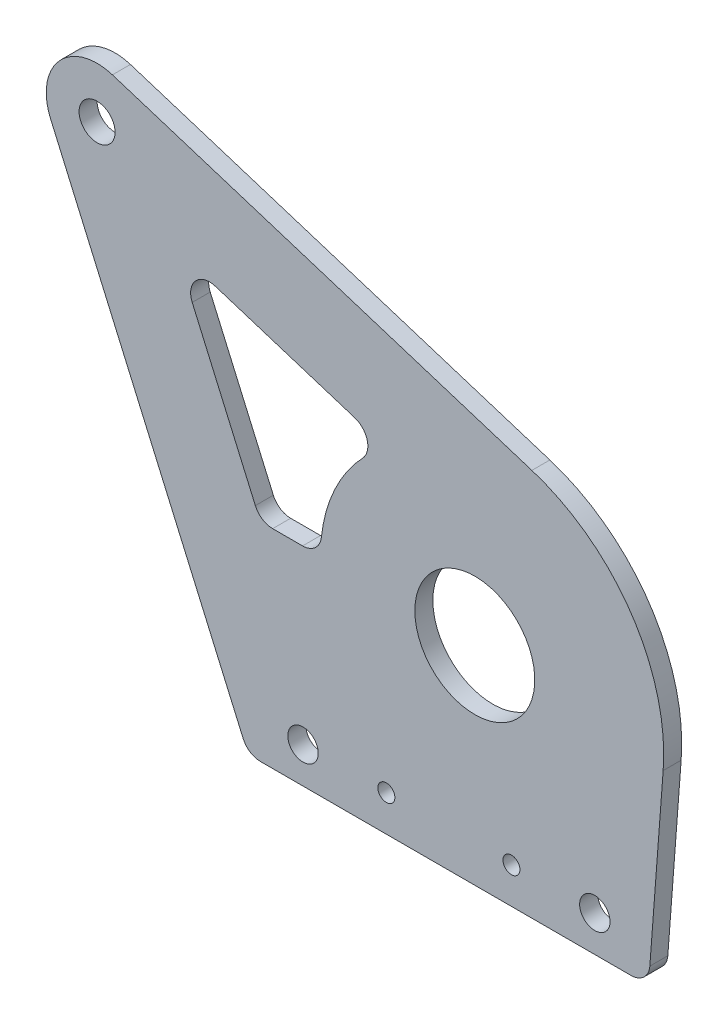
ISO-10303-21;
HEADER;
FILE_DESCRIPTION(('STEP AP214'),'2;1');
FILE_NAME('part.step','',(''),(''),'','','');
FILE_SCHEMA(('AUTOMOTIVE_DESIGN { 1 0 10303 214 1 1 1 1 }'));
ENDSEC;
DATA;
#1=APPLICATION_CONTEXT('core data for automotive mechanical design processes');
#2=APPLICATION_PROTOCOL_DEFINITION('international standard','automotive_design',2000,#1);
#3=PRODUCT_CONTEXT('',#1,'mechanical');
#4=PRODUCT('Part','Part','',(#3));
#5=PRODUCT_RELATED_PRODUCT_CATEGORY('part','',(#4));
#6=PRODUCT_DEFINITION_FORMATION('','',#4);
#7=PRODUCT_DEFINITION_CONTEXT('part definition',#1,'design');
#8=PRODUCT_DEFINITION('design','',#6,#7);
#9=PRODUCT_DEFINITION_SHAPE('','',#8);
#10=(LENGTH_UNIT() NAMED_UNIT(*) SI_UNIT(.MILLI.,.METRE.));
#11=(NAMED_UNIT(*) PLANE_ANGLE_UNIT() SI_UNIT($,.RADIAN.));
#12=(NAMED_UNIT(*) SI_UNIT($,.STERADIAN.) SOLID_ANGLE_UNIT());
#13=UNCERTAINTY_MEASURE_WITH_UNIT(LENGTH_MEASURE(1.E-05),#10,'distance_accuracy_value','');
#14=(GEOMETRIC_REPRESENTATION_CONTEXT(3) GLOBAL_UNCERTAINTY_ASSIGNED_CONTEXT((#13)) GLOBAL_UNIT_ASSIGNED_CONTEXT((#10,
#11,#12)) REPRESENTATION_CONTEXT('',''));
#15=CARTESIAN_POINT('',(0.,0.,0.));
#16=DIRECTION('',(0.,0.,1.));
#17=DIRECTION('',(1.,0.,0.));
#18=AXIS2_PLACEMENT_3D('',#15,#16,#17);
#19=CARTESIAN_POINT('',(-45.9765237436757,55.,34.7625));
#20=DIRECTION('',(0.,0.,-1.));
#21=DIRECTION('',(-1.,0.,0.));
#22=AXIS2_PLACEMENT_3D('',#19,#20,#21);
#23=CYLINDRICAL_SURFACE('',#22,50.);
#24=CARTESIAN_POINT('',(-45.9765237436757,55.,30.));
#25=DIRECTION('',(0.,0.,1.));
#26=DIRECTION('',(-1.,0.,0.));
#27=AXIS2_PLACEMENT_3D('',#24,#25,#26);
#28=CIRCLE('',#27,50.);
#29=CARTESIAN_POINT('',(3.88060445728038,51.2228625185952,30.));
#30=VERTEX_POINT('',#29);
#31=CARTESIAN_POINT('',(-30.8816537026386,102.667021077934,30.));
#32=VERTEX_POINT('',#31);
#33=EDGE_CURVE('E184',#30,#32,#28,.T.);
#34=ORIENTED_EDGE('',*,*,#33,.T.);
#35=DIRECTION('',(0.,0.,-1.));
#36=VECTOR('',#35,1.);
#37=CARTESIAN_POINT('',(-30.8816537026386,102.667021077934,34.7625));
#38=LINE('',#37,#36);
#39=CARTESIAN_POINT('',(-30.8816537026386,102.667021077934,34.7625));
#40=VERTEX_POINT('',#39);
#41=EDGE_CURVE('E162',#40,#32,#38,.T.);
#42=ORIENTED_EDGE('',*,*,#41,.F.);
#43=CARTESIAN_POINT('',(-45.9765237436757,55.,34.7625));
#44=DIRECTION('',(0.,0.,1.));
#45=DIRECTION('',(-1.,0.,0.));
#46=AXIS2_PLACEMENT_3D('',#43,#44,#45);
#47=CIRCLE('',#46,50.);
#48=CARTESIAN_POINT('',(3.88060445728038,51.2228625185952,34.7625));
#49=VERTEX_POINT('',#48);
#50=EDGE_CURVE('E170',#49,#40,#47,.T.);
#51=ORIENTED_EDGE('',*,*,#50,.F.);
#52=DIRECTION('',(0.,0.,-1.));
#53=VECTOR('',#52,1.);
#54=CARTESIAN_POINT('',(3.88060445728038,51.2228625185952,34.7625));
#55=LINE('',#54,#53);
#56=EDGE_CURVE('E367',#49,#30,#55,.T.);
#57=ORIENTED_EDGE('',*,*,#56,.T.);
#58=EDGE_LOOP('',(#34,#42,#51,#57));
#59=FACE_BOUND('',#58,.T.);
#60=ADVANCED_FACE('F44',(#59),#23,.T.);
#61=CARTESIAN_POINT('',(-141.914219316021,137.828063458088,34.7625));
#62=DIRECTION('',(-0.301897400820741,-0.95334042155868,0.));
#63=DIRECTION('',(0.95334042155868,-0.301897400820741,0.));
#64=AXIS2_PLACEMENT_3D('',#61,#62,#63);
#65=PLANE('',#64);
#66=DIRECTION('',(-0.95334042155868,0.301897400820741,0.));
#67=VECTOR('',#66,1.);
#68=CARTESIAN_POINT('',(-141.914219316021,137.828063458088,30.));
#69=LINE('',#68,#67);
#70=CARTESIAN_POINT('',(-141.914219316021,137.828063458088,30.));
#71=VERTEX_POINT('',#70);
#72=EDGE_CURVE('E369',#32,#71,#69,.T.);
#73=ORIENTED_EDGE('',*,*,#72,.T.);
#74=DIRECTION('',(0.,0.,-1.));
#75=VECTOR('',#74,1.);
#76=CARTESIAN_POINT('',(-141.914219316021,137.828063458088,34.7625));
#77=LINE('',#76,#75);
#78=CARTESIAN_POINT('',(-141.914219316021,137.828063458088,34.7625));
#79=VERTEX_POINT('',#78);
#80=EDGE_CURVE('E165',#79,#71,#77,.T.);
#81=ORIENTED_EDGE('',*,*,#80,.F.);
#82=DIRECTION('',(-0.95334042155868,0.301897400820741,0.));
#83=VECTOR('',#82,1.);
#84=CARTESIAN_POINT('',(-141.914219316021,137.828063458088,34.7625));
#85=LINE('',#84,#83);
#86=EDGE_CURVE('E158',#40,#79,#85,.T.);
#87=ORIENTED_EDGE('',*,*,#86,.F.);
#88=ORIENTED_EDGE('',*,*,#41,.T.);
#89=EDGE_LOOP('',(#73,#81,#87,#88));
#90=FACE_BOUND('',#89,.T.);
#91=ADVANCED_FACE('F160',(#90),#65,.F.);
#92=CARTESIAN_POINT('',(-145.976523743676,125.,34.7625));
#93=DIRECTION('',(0.,0.,-1.));
#94=DIRECTION('',(-1.,0.,0.));
#95=AXIS2_PLACEMENT_3D('',#92,#93,#94);
#96=CYLINDRICAL_SURFACE('',#95,13.4559105729665);
#97=CARTESIAN_POINT('',(-145.976523743676,125.,30.));
#98=DIRECTION('',(0.,0.,1.));
#99=DIRECTION('',(1.,0.,0.));
#100=AXIS2_PLACEMENT_3D('',#97,#98,#99);
#101=CIRCLE('',#100,13.4559105729665);
#102=CARTESIAN_POINT('',(-158.305149544898,119.608662948663,30.));
#103=VERTEX_POINT('',#102);
#104=EDGE_CURVE('E372',#71,#103,#101,.T.);
#105=ORIENTED_EDGE('',*,*,#104,.T.);
#106=DIRECTION('',(0.,0.,-1.));
#107=VECTOR('',#106,1.);
#108=CARTESIAN_POINT('',(-158.305149544898,119.608662948663,34.7625));
#109=LINE('',#108,#107);
#110=CARTESIAN_POINT('',(-158.305149544898,119.608662948663,34.7625));
#111=VERTEX_POINT('',#110);
#112=EDGE_CURVE('E195',#111,#103,#109,.T.);
#113=ORIENTED_EDGE('',*,*,#112,.F.);
#114=CARTESIAN_POINT('',(-145.976523743676,125.,34.7625));
#115=DIRECTION('',(0.,0.,1.));
#116=DIRECTION('',(1.,0.,0.));
#117=AXIS2_PLACEMENT_3D('',#114,#115,#116);
#118=CIRCLE('',#117,13.4559105729665);
#119=EDGE_CURVE('E169',#79,#111,#118,.T.);
#120=ORIENTED_EDGE('',*,*,#119,.F.);
#121=ORIENTED_EDGE('',*,*,#80,.T.);
#122=EDGE_LOOP('',(#105,#113,#120,#121));
#123=FACE_BOUND('',#122,.T.);
#124=ADVANCED_FACE('F414',(#123),#96,.T.);
#125=CARTESIAN_POINT('',(-106.,0.,34.7625));
#126=DIRECTION('',(0.916223821076116,0.400666831285897,0.));
#127=DIRECTION('',(-0.400666831285897,0.916223821076116,0.));
#128=AXIS2_PLACEMENT_3D('',#125,#126,#127);
#129=PLANE('',#128);
#130=DIRECTION('',(0.400666831285897,-0.916223821076116,0.));
#131=VECTOR('',#130,1.);
#132=CARTESIAN_POINT('',(-106.,0.,30.));
#133=LINE('',#132,#131);
#134=CARTESIAN_POINT('',(-107.310449019494,2.9966658435705,30.));
#135=VERTEX_POINT('',#134);
#136=EDGE_CURVE('E375',#103,#135,#133,.T.);
#137=ORIENTED_EDGE('',*,*,#136,.T.);
#138=DIRECTION('',(0.,0.,-1.));
#139=VECTOR('',#138,1.);
#140=CARTESIAN_POINT('',(-107.310449019494,2.9966658435705,34.7625));
#141=LINE('',#140,#139);
#142=CARTESIAN_POINT('',(-107.310449019494,2.9966658435705,34.7625));
#143=VERTEX_POINT('',#142);
#144=EDGE_CURVE('E227',#135,#143,#141,.F.);
#145=ORIENTED_EDGE('',*,*,#144,.T.);
#146=DIRECTION('',(0.400666831285897,-0.916223821076116,0.));
#147=VECTOR('',#146,1.);
#148=CARTESIAN_POINT('',(-106.,0.,34.7625));
#149=LINE('',#148,#147);
#150=EDGE_CURVE('E359',#111,#143,#149,.T.);
#151=ORIENTED_EDGE('',*,*,#150,.F.);
#152=ORIENTED_EDGE('',*,*,#112,.T.);
#153=EDGE_LOOP('',(#137,#145,#151,#152));
#154=FACE_BOUND('',#153,.T.);
#155=ADVANCED_FACE('F392',(#154),#129,.F.);
#156=CARTESIAN_POINT('',(0.,0.,34.7625));
#157=DIRECTION('',(0.,1.,0.));
#158=DIRECTION('',(-1.,0.,0.));
#159=AXIS2_PLACEMENT_3D('',#156,#157,#158);
#160=PLANE('',#159);
#161=DIRECTION('',(1.,0.,0.));
#162=VECTOR('',#161,1.);
#163=CARTESIAN_POINT('',(0.,0.,30.));
#164=LINE('',#163,#162);
#165=CARTESIAN_POINT('',(-102.729329914113,0.,30.));
#166=VERTEX_POINT('',#165);
#167=CARTESIAN_POINT('',(-4.63553198775184,0.,30.));
#168=VERTEX_POINT('',#167);
#169=EDGE_CURVE('E379',#166,#168,#164,.T.);
#170=ORIENTED_EDGE('',*,*,#169,.T.);
#171=DIRECTION('',(0.,0.,-1.));
#172=VECTOR('',#171,1.);
#173=CARTESIAN_POINT('',(-4.63553198775184,0.,34.7625));
#174=LINE('',#173,#172);
#175=CARTESIAN_POINT('',(-4.63553198775184,0.,34.7625));
#176=VERTEX_POINT('',#175);
#177=EDGE_CURVE('E219',#168,#176,#174,.F.);
#178=ORIENTED_EDGE('',*,*,#177,.T.);
#179=DIRECTION('',(1.,0.,0.));
#180=VECTOR('',#179,1.);
#181=CARTESIAN_POINT('',(0.,0.,34.7625));
#182=LINE('',#181,#180);
#183=CARTESIAN_POINT('',(-102.729329914113,0.,34.7625));
#184=VERTEX_POINT('',#183);
#185=EDGE_CURVE('E362',#184,#176,#182,.T.);
#186=ORIENTED_EDGE('',*,*,#185,.F.);
#187=DIRECTION('',(0.,0.,-1.));
#188=VECTOR('',#187,1.);
#189=CARTESIAN_POINT('',(-102.729329914113,0.,34.7625));
#190=LINE('',#189,#188);
#191=EDGE_CURVE('E215',#184,#166,#190,.T.);
#192=ORIENTED_EDGE('',*,*,#191,.T.);
#193=EDGE_LOOP('',(#170,#178,#186,#192));
#194=FACE_BOUND('',#193,.T.);
#195=ADVANCED_FACE('F406',(#194),#160,.F.);
#196=CARTESIAN_POINT('',(0.,0.,34.7625));
#197=DIRECTION('',(-0.997142564019121,0.0755427496280952,0.));
#198=DIRECTION('',(-0.0755427496280952,-0.997142564019121,0.));
#199=AXIS2_PLACEMENT_3D('',#196,#197,#198);
#200=PLANE('',#199);
#201=DIRECTION('',(0.0755427496280952,0.997142564019121,0.));
#202=VECTOR('',#201,1.);
#203=CARTESIAN_POINT('',(0.,0.,34.7625));
#204=LINE('',#203,#202);
#205=CARTESIAN_POINT('',(0.350180832343764,4.62228625185952,34.7625));
#206=VERTEX_POINT('',#205);
#207=EDGE_CURVE('E176',#206,#49,#204,.T.);
#208=ORIENTED_EDGE('',*,*,#207,.F.);
#209=DIRECTION('',(0.,0.,-1.));
#210=VECTOR('',#209,1.);
#211=CARTESIAN_POINT('',(0.350180832343764,4.62228625185952,34.7625));
#212=LINE('',#211,#210);
#213=CARTESIAN_POINT('',(0.350180832343764,4.62228625185952,30.));
#214=VERTEX_POINT('',#213);
#215=EDGE_CURVE('E186',#206,#214,#212,.T.);
#216=ORIENTED_EDGE('',*,*,#215,.T.);
#217=DIRECTION('',(0.0755427496280952,0.997142564019121,0.));
#218=VECTOR('',#217,1.);
#219=CARTESIAN_POINT('',(0.,0.,30.));
#220=LINE('',#219,#218);
#221=EDGE_CURVE('E181',#214,#30,#220,.T.);
#222=ORIENTED_EDGE('',*,*,#221,.T.);
#223=ORIENTED_EDGE('',*,*,#56,.F.);
#224=EDGE_LOOP('',(#208,#216,#222,#223));
#225=FACE_BOUND('',#224,.T.);
#226=ADVANCED_FACE('F413',(#225),#200,.F.);
#227=CARTESIAN_POINT('',(-45.9765237436757,55.,34.7625));
#228=DIRECTION('',(0.,0.,-1.));
#229=DIRECTION('',(-1.,0.,0.));
#230=AXIS2_PLACEMENT_3D('',#227,#228,#229);
#231=PLANE('',#230);
#232=DIRECTION('',(1.,0.,0.));
#233=VECTOR('',#232,1.);
#234=CARTESIAN_POINT('',(-102.765720109967,55.,34.7625));
#235=LINE('',#234,#233);
#236=CARTESIAN_POINT('',(-99.4950500240803,55.,34.7625));
#237=VERTEX_POINT('',#236);
#238=CARTESIAN_POINT('',(-91.5782301262224,55.,34.7625));
#239=VERTEX_POINT('',#238);
#240=EDGE_CURVE('E314',#237,#239,#235,.T.);
#241=ORIENTED_EDGE('',*,*,#240,.F.);
#242=CARTESIAN_POINT('',(-99.4950500240803,60.,34.7625));
#243=DIRECTION('',(0.,0.,-1.));
#244=DIRECTION('',(-1.,0.,0.));
#245=AXIS2_PLACEMENT_3D('',#242,#243,#244);
#246=CIRCLE('',#245,5.);
#247=CARTESIAN_POINT('',(-104.076169129461,57.9966658435705,34.7625));
#248=VERTEX_POINT('',#247);
#249=EDGE_CURVE('E269',#237,#248,#246,.T.);
#250=ORIENTED_EDGE('',*,*,#249,.T.);
#251=DIRECTION('',(0.400666831285897,-0.916223821076116,0.));
#252=VECTOR('',#251,1.);
#253=CARTESIAN_POINT('',(-125.205078879288,106.313144559887,34.7625));
#254=LINE('',#253,#252);
#255=CARTESIAN_POINT('',(-120.7896266242,96.2161207459809,34.7625));
#256=VERTEX_POINT('',#255);
#257=EDGE_CURVE('E283',#256,#248,#254,.T.);
#258=ORIENTED_EDGE('',*,*,#257,.F.);
#259=CARTESIAN_POINT('',(-116.208507518819,98.2194549024104,34.7625));
#260=DIRECTION('',(0.,0.,-1.));
#261=DIRECTION('',(-1.,0.,0.));
#262=AXIS2_PLACEMENT_3D('',#259,#260,#261);
#263=CIRCLE('',#262,5.);
#264=CARTESIAN_POINT('',(-114.699020514716,102.986157010204,34.7625));
#265=VERTEX_POINT('',#264);
#266=EDGE_CURVE('E53',#256,#265,#263,.T.);
#267=ORIENTED_EDGE('',*,*,#266,.T.);
#268=DIRECTION('',(-0.95334042155868,0.30189740082074,0.));
#269=VECTOR('',#268,1.);
#270=CARTESIAN_POINT('',(-125.205078879288,106.313144559887,34.7625));
#271=LINE('',#270,#269);
#272=CARTESIAN_POINT('',(-77.7884915726018,91.297580192781,34.7625));
#273=VERTEX_POINT('',#272);
#274=EDGE_CURVE('E282',#273,#265,#271,.T.);
#275=ORIENTED_EDGE('',*,*,#274,.F.);
#276=CARTESIAN_POINT('',(-79.2979785767055,86.5308780849876,34.7625));
#277=DIRECTION('',(0.,0.,-1.));
#278=DIRECTION('',(-1.,0.,0.));
#279=AXIS2_PLACEMENT_3D('',#276,#277,#278);
#280=CIRCLE('',#279,5.);
#281=CARTESIAN_POINT('',(-75.6662123823698,83.0942701193214,34.7625));
#282=VERTEX_POINT('',#281);
#283=EDGE_CURVE('E257',#273,#282,#280,.T.);
#284=ORIENTED_EDGE('',*,*,#283,.T.);
#285=CARTESIAN_POINT('',(-45.9765237436757,55.,34.7625));
#286=DIRECTION('',(0.,0.,-1.));
#287=DIRECTION('',(1.,0.,0.));
#288=AXIS2_PLACEMENT_3D('',#285,#286,#287);
#289=CIRCLE('',#288,40.875);
#290=CARTESIAN_POINT('',(-86.608016896517,59.4550408719346,34.7625));
#291=VERTEX_POINT('',#290);
#292=EDGE_CURVE('E293',#291,#282,#289,.T.);
#293=ORIENTED_EDGE('',*,*,#292,.F.);
#294=CARTESIAN_POINT('',(-91.5782301262224,60.,34.7625));
#295=DIRECTION('',(0.,0.,-1.));
#296=DIRECTION('',(-1.,0.,0.));
#297=AXIS2_PLACEMENT_3D('',#294,#295,#296);
#298=CIRCLE('',#297,5.);
#299=EDGE_CURVE('E263',#291,#239,#298,.T.);
#300=ORIENTED_EDGE('',*,*,#299,.T.);
#301=EDGE_LOOP('',(#241,#250,#258,#267,#275,#284,#293,#300));
#302=FACE_BOUND('',#301,.T.);
#303=CARTESIAN_POINT('',(-69.3886421718834,9.525,34.7625));
#304=DIRECTION('',(0.,0.,1.));
#305=DIRECTION('',(1.,0.,0.));
#306=AXIS2_PLACEMENT_3D('',#303,#304,#305);
#307=CIRCLE('',#306,2.24999999999999);
#308=CARTESIAN_POINT('',(-67.1386421718834,9.525,34.7625));
#309=VERTEX_POINT('',#308);
#310=EDGE_CURVE('E311',#309,#309,#307,.T.);
#311=ORIENTED_EDGE('',*,*,#310,.F.);
#312=EDGE_LOOP('',(#311));
#313=FACE_BOUND('',#312,.T.);
#314=CARTESIAN_POINT('',(-36.2818211132944,9.525,34.7625));
#315=DIRECTION('',(0.,0.,1.));
#316=DIRECTION('',(1.,0.,0.));
#317=AXIS2_PLACEMENT_3D('',#314,#315,#316);
#318=CIRCLE('',#317,2.25);
#319=CARTESIAN_POINT('',(-34.0318211132945,9.525,34.7625));
#320=VERTEX_POINT('',#319);
#321=EDGE_CURVE('E328',#320,#320,#318,.T.);
#322=ORIENTED_EDGE('',*,*,#321,.F.);
#323=EDGE_LOOP('',(#322));
#324=FACE_BOUND('',#323,.T.);
#325=CARTESIAN_POINT('',(-91.4598564098834,9.52499999999999,34.7625));
#326=DIRECTION('',(0.,0.,1.));
#327=DIRECTION('',(1.,0.,0.));
#328=AXIS2_PLACEMENT_3D('',#325,#326,#327);
#329=CIRCLE('',#328,4.025);
#330=CARTESIAN_POINT('',(-87.4348564098834,9.52499999999999,34.7625));
#331=VERTEX_POINT('',#330);
#332=EDGE_CURVE('E204',#331,#331,#329,.T.);
#333=ORIENTED_EDGE('',*,*,#332,.F.);
#334=EDGE_LOOP('',(#333));
#335=FACE_BOUND('',#334,.T.);
#336=CARTESIAN_POINT('',(-14.2106070377648,9.52500000000001,34.7625));
#337=DIRECTION('',(0.,0.,1.));
#338=DIRECTION('',(1.,0.,0.));
#339=AXIS2_PLACEMENT_3D('',#336,#337,#338);
#340=CIRCLE('',#339,4.025);
#341=CARTESIAN_POINT('',(-10.1856070377648,9.52500000000001,34.7625));
#342=VERTEX_POINT('',#341);
#343=EDGE_CURVE('E344',#342,#342,#340,.T.);
#344=ORIENTED_EDGE('',*,*,#343,.F.);
#345=EDGE_LOOP('',(#344));
#346=FACE_BOUND('',#345,.T.);
#347=CARTESIAN_POINT('',(-45.9765237436757,55.,34.7625));
#348=DIRECTION('',(0.,0.,-1.));
#349=DIRECTION('',(-1.,0.,0.));
#350=AXIS2_PLACEMENT_3D('',#347,#348,#349);
#351=CIRCLE('',#350,15.875);
#352=CARTESIAN_POINT('',(-61.8515237436757,55.,34.7625));
#353=VERTEX_POINT('',#352);
#354=EDGE_CURVE('E208',#353,#353,#351,.T.);
#355=ORIENTED_EDGE('',*,*,#354,.T.);
#356=EDGE_LOOP('',(#355));
#357=FACE_BOUND('',#356,.T.);
#358=CARTESIAN_POINT('',(-145.976523743676,125.,34.7625));
#359=DIRECTION('',(0.,0.,-1.));
#360=DIRECTION('',(-1.,0.,0.));
#361=AXIS2_PLACEMENT_3D('',#358,#359,#360);
#362=CIRCLE('',#361,4.76250000000001);
#363=CARTESIAN_POINT('',(-150.739023743676,125.,34.7625));
#364=VERTEX_POINT('',#363);
#365=EDGE_CURVE('E203',#364,#364,#362,.T.);
#366=ORIENTED_EDGE('',*,*,#365,.T.);
#367=EDGE_LOOP('',(#366));
#368=FACE_BOUND('',#367,.T.);
#369=ORIENTED_EDGE('',*,*,#185,.T.);
#370=CARTESIAN_POINT('',(-4.63553198775184,5.,34.7625));
#371=DIRECTION('',(0.,0.,-1.));
#372=DIRECTION('',(-1.,0.,0.));
#373=AXIS2_PLACEMENT_3D('',#370,#371,#372);
#374=CIRCLE('',#373,5.);
#375=EDGE_CURVE('E224',#176,#206,#374,.F.);
#376=ORIENTED_EDGE('',*,*,#375,.T.);
#377=ORIENTED_EDGE('',*,*,#207,.T.);
#378=ORIENTED_EDGE('',*,*,#50,.T.);
#379=ORIENTED_EDGE('',*,*,#86,.T.);
#380=ORIENTED_EDGE('',*,*,#119,.T.);
#381=ORIENTED_EDGE('',*,*,#150,.T.);
#382=CARTESIAN_POINT('',(-102.729329914113,4.99999999999998,34.7625));
#383=DIRECTION('',(0.,0.,-1.));
#384=DIRECTION('',(-1.,0.,0.));
#385=AXIS2_PLACEMENT_3D('',#382,#383,#384);
#386=CIRCLE('',#385,5.);
#387=EDGE_CURVE('E222',#143,#184,#386,.F.);
#388=ORIENTED_EDGE('',*,*,#387,.T.);
#389=EDGE_LOOP('',(#369,#376,#377,#378,#379,#380,#381,#388));
#390=FACE_BOUND('',#389,.T.);
#391=ADVANCED_FACE('F174',(#302,#313,#324,#335,#346,#357,#368,#390),#231,.F.);
#392=CARTESIAN_POINT('',(-45.9765237436757,55.,30.));
#393=DIRECTION('',(0.,0.,-1.));
#394=DIRECTION('',(-1.,0.,0.));
#395=AXIS2_PLACEMENT_3D('',#392,#393,#394);
#396=PLANE('',#395);
#397=DIRECTION('',(-0.95334042155868,0.30189740082074,0.));
#398=VECTOR('',#397,1.);
#399=CARTESIAN_POINT('',(-125.205078879288,106.313144559887,30.));
#400=LINE('',#399,#398);
#401=CARTESIAN_POINT('',(-77.7884915726018,91.297580192781,30.));
#402=VERTEX_POINT('',#401);
#403=CARTESIAN_POINT('',(-114.699020514716,102.986157010204,30.));
#404=VERTEX_POINT('',#403);
#405=EDGE_CURVE('E308',#402,#404,#400,.T.);
#406=ORIENTED_EDGE('',*,*,#405,.T.);
#407=CARTESIAN_POINT('',(-116.208507518819,98.2194549024104,30.));
#408=DIRECTION('',(0.,0.,-1.));
#409=DIRECTION('',(-1.,0.,0.));
#410=AXIS2_PLACEMENT_3D('',#407,#408,#409);
#411=CIRCLE('',#410,5.);
#412=CARTESIAN_POINT('',(-120.7896266242,96.2161207459809,30.));
#413=VERTEX_POINT('',#412);
#414=EDGE_CURVE('E11',#404,#413,#411,.F.);
#415=ORIENTED_EDGE('',*,*,#414,.T.);
#416=DIRECTION('',(0.400666831285897,-0.916223821076116,0.));
#417=VECTOR('',#416,1.);
#418=CARTESIAN_POINT('',(-125.205078879288,106.313144559887,30.));
#419=LINE('',#418,#417);
#420=CARTESIAN_POINT('',(-104.076169129461,57.9966658435705,30.));
#421=VERTEX_POINT('',#420);
#422=EDGE_CURVE('E292',#413,#421,#419,.T.);
#423=ORIENTED_EDGE('',*,*,#422,.T.);
#424=CARTESIAN_POINT('',(-99.4950500240803,60.,30.));
#425=DIRECTION('',(0.,0.,-1.));
#426=DIRECTION('',(-1.,0.,0.));
#427=AXIS2_PLACEMENT_3D('',#424,#425,#426);
#428=CIRCLE('',#427,5.);
#429=CARTESIAN_POINT('',(-99.4950500240803,55.,30.));
#430=VERTEX_POINT('',#429);
#431=EDGE_CURVE('E272',#421,#430,#428,.F.);
#432=ORIENTED_EDGE('',*,*,#431,.T.);
#433=DIRECTION('',(1.,0.,0.));
#434=VECTOR('',#433,1.);
#435=CARTESIAN_POINT('',(-102.765720109967,55.,30.));
#436=LINE('',#435,#434);
#437=CARTESIAN_POINT('',(-91.5782301262224,55.,30.));
#438=VERTEX_POINT('',#437);
#439=EDGE_CURVE('E298',#430,#438,#436,.T.);
#440=ORIENTED_EDGE('',*,*,#439,.T.);
#441=CARTESIAN_POINT('',(-91.5782301262224,60.,30.));
#442=DIRECTION('',(0.,0.,-1.));
#443=DIRECTION('',(-1.,0.,0.));
#444=AXIS2_PLACEMENT_3D('',#441,#442,#443);
#445=CIRCLE('',#444,5.);
#446=CARTESIAN_POINT('',(-86.608016896517,59.4550408719346,30.));
#447=VERTEX_POINT('',#446);
#448=EDGE_CURVE('E266',#438,#447,#445,.F.);
#449=ORIENTED_EDGE('',*,*,#448,.T.);
#450=CARTESIAN_POINT('',(-45.9765237436757,55.,30.));
#451=DIRECTION('',(0.,0.,-1.));
#452=DIRECTION('',(1.,0.,0.));
#453=AXIS2_PLACEMENT_3D('',#450,#451,#452);
#454=CIRCLE('',#453,40.875);
#455=CARTESIAN_POINT('',(-75.6662123823698,83.0942701193214,30.));
#456=VERTEX_POINT('',#455);
#457=EDGE_CURVE('E302',#447,#456,#454,.T.);
#458=ORIENTED_EDGE('',*,*,#457,.T.);
#459=CARTESIAN_POINT('',(-79.2979785767055,86.5308780849876,30.));
#460=DIRECTION('',(0.,0.,-1.));
#461=DIRECTION('',(-1.,0.,0.));
#462=AXIS2_PLACEMENT_3D('',#459,#460,#461);
#463=CIRCLE('',#462,5.);
#464=EDGE_CURVE('E260',#456,#402,#463,.F.);
#465=ORIENTED_EDGE('',*,*,#464,.T.);
#466=EDGE_LOOP('',(#406,#415,#423,#432,#440,#449,#458,#465));
#467=FACE_BOUND('',#466,.T.);
#468=CARTESIAN_POINT('',(-69.3886421718834,9.525,30.));
#469=DIRECTION('',(0.,0.,-1.));
#470=DIRECTION('',(-1.,0.,0.));
#471=AXIS2_PLACEMENT_3D('',#468,#469,#470);
#472=CIRCLE('',#471,2.24999999999999);
#473=CARTESIAN_POINT('',(-71.6386421718834,9.525,30.));
#474=VERTEX_POINT('',#473);
#475=EDGE_CURVE('E324',#474,#474,#472,.T.);
#476=ORIENTED_EDGE('',*,*,#475,.F.);
#477=EDGE_LOOP('',(#476));
#478=FACE_BOUND('',#477,.T.);
#479=CARTESIAN_POINT('',(-36.2818211132944,9.525,30.));
#480=DIRECTION('',(0.,0.,-1.));
#481=DIRECTION('',(-1.,0.,0.));
#482=AXIS2_PLACEMENT_3D('',#479,#480,#481);
#483=CIRCLE('',#482,2.25);
#484=CARTESIAN_POINT('',(-38.5318211132944,9.525,30.));
#485=VERTEX_POINT('',#484);
#486=EDGE_CURVE('E332',#485,#485,#483,.T.);
#487=ORIENTED_EDGE('',*,*,#486,.F.);
#488=EDGE_LOOP('',(#487));
#489=FACE_BOUND('',#488,.T.);
#490=CARTESIAN_POINT('',(-91.4598564098834,9.52499999999999,30.));
#491=DIRECTION('',(0.,0.,-1.));
#492=DIRECTION('',(-1.,0.,0.));
#493=AXIS2_PLACEMENT_3D('',#490,#491,#492);
#494=CIRCLE('',#493,4.025);
#495=CARTESIAN_POINT('',(-87.4348564098834,9.52499999999999,30.));
#496=VERTEX_POINT('',#495);
#497=EDGE_CURVE('E340',#496,#496,#494,.F.);
#498=ORIENTED_EDGE('',*,*,#497,.T.);
#499=EDGE_LOOP('',(#498));
#500=FACE_BOUND('',#499,.T.);
#501=CARTESIAN_POINT('',(-14.2106070377648,9.52500000000001,30.));
#502=DIRECTION('',(0.,0.,-1.));
#503=DIRECTION('',(-1.,0.,0.));
#504=AXIS2_PLACEMENT_3D('',#501,#502,#503);
#505=CIRCLE('',#504,4.025);
#506=CARTESIAN_POINT('',(-10.1856070377648,9.52500000000001,30.));
#507=VERTEX_POINT('',#506);
#508=EDGE_CURVE('E336',#507,#507,#505,.F.);
#509=ORIENTED_EDGE('',*,*,#508,.T.);
#510=EDGE_LOOP('',(#509));
#511=FACE_BOUND('',#510,.T.);
#512=CARTESIAN_POINT('',(-45.9765237436757,55.,30.));
#513=DIRECTION('',(0.,0.,-1.));
#514=DIRECTION('',(-1.,0.,0.));
#515=AXIS2_PLACEMENT_3D('',#512,#513,#514);
#516=CIRCLE('',#515,15.875);
#517=CARTESIAN_POINT('',(-61.8515237436757,55.,30.));
#518=VERTEX_POINT('',#517);
#519=EDGE_CURVE('E205',#518,#518,#516,.T.);
#520=ORIENTED_EDGE('',*,*,#519,.F.);
#521=EDGE_LOOP('',(#520));
#522=FACE_BOUND('',#521,.T.);
#523=CARTESIAN_POINT('',(-145.976523743676,125.,30.));
#524=DIRECTION('',(0.,0.,-1.));
#525=DIRECTION('',(-1.,0.,0.));
#526=AXIS2_PLACEMENT_3D('',#523,#524,#525);
#527=CIRCLE('',#526,4.76250000000001);
#528=CARTESIAN_POINT('',(-150.739023743676,125.,30.));
#529=VERTEX_POINT('',#528);
#530=EDGE_CURVE('E199',#529,#529,#527,.T.);
#531=ORIENTED_EDGE('',*,*,#530,.F.);
#532=EDGE_LOOP('',(#531));
#533=FACE_BOUND('',#532,.T.);
#534=ORIENTED_EDGE('',*,*,#221,.F.);
#535=CARTESIAN_POINT('',(-4.63553198775184,5.,30.));
#536=DIRECTION('',(0.,0.,-1.));
#537=DIRECTION('',(-1.,0.,0.));
#538=AXIS2_PLACEMENT_3D('',#535,#536,#537);
#539=CIRCLE('',#538,5.);
#540=EDGE_CURVE('E212',#214,#168,#539,.T.);
#541=ORIENTED_EDGE('',*,*,#540,.T.);
#542=ORIENTED_EDGE('',*,*,#169,.F.);
#543=CARTESIAN_POINT('',(-102.729329914113,4.99999999999998,30.));
#544=DIRECTION('',(0.,0.,-1.));
#545=DIRECTION('',(-1.,0.,0.));
#546=AXIS2_PLACEMENT_3D('',#543,#544,#545);
#547=CIRCLE('',#546,5.);
#548=EDGE_CURVE('E192',#166,#135,#547,.T.);
#549=ORIENTED_EDGE('',*,*,#548,.T.);
#550=ORIENTED_EDGE('',*,*,#136,.F.);
#551=ORIENTED_EDGE('',*,*,#104,.F.);
#552=ORIENTED_EDGE('',*,*,#72,.F.);
#553=ORIENTED_EDGE('',*,*,#33,.F.);
#554=EDGE_LOOP('',(#534,#541,#542,#549,#550,#551,#552,#553));
#555=FACE_BOUND('',#554,.T.);
#556=ADVANCED_FACE('F398',(#467,#478,#489,#500,#511,#522,#533,#555),#396,.T.);
#557=CARTESIAN_POINT('',(-145.976523743676,125.,0.));
#558=DIRECTION('',(0.,0.,1.));
#559=DIRECTION('',(1.,0.,0.));
#560=AXIS2_PLACEMENT_3D('',#557,#558,#559);
#561=CYLINDRICAL_SURFACE('',#560,4.76250000000001);
#562=ORIENTED_EDGE('',*,*,#530,.T.);
#563=EDGE_LOOP('',(#562));
#564=FACE_BOUND('',#563,.T.);
#565=ORIENTED_EDGE('',*,*,#365,.F.);
#566=EDGE_LOOP('',(#565));
#567=FACE_BOUND('',#566,.T.);
#568=ADVANCED_FACE('F489',(#564,#567),#561,.F.);
#569=CARTESIAN_POINT('',(-45.9765237436757,55.,0.));
#570=DIRECTION('',(0.,0.,1.));
#571=DIRECTION('',(1.,0.,0.));
#572=AXIS2_PLACEMENT_3D('',#569,#570,#571);
#573=CYLINDRICAL_SURFACE('',#572,15.875);
#574=ORIENTED_EDGE('',*,*,#519,.T.);
#575=EDGE_LOOP('',(#574));
#576=FACE_BOUND('',#575,.T.);
#577=ORIENTED_EDGE('',*,*,#354,.F.);
#578=EDGE_LOOP('',(#577));
#579=FACE_BOUND('',#578,.T.);
#580=ADVANCED_FACE('F430',(#576,#579),#573,.F.);
#581=CARTESIAN_POINT('',(-4.63553198775184,5.,34.7625));
#582=DIRECTION('',(0.,0.,-1.));
#583=DIRECTION('',(-1.,0.,0.));
#584=AXIS2_PLACEMENT_3D('',#581,#582,#583);
#585=CYLINDRICAL_SURFACE('',#584,5.);
#586=ORIENTED_EDGE('',*,*,#375,.F.);
#587=ORIENTED_EDGE('',*,*,#177,.F.);
#588=ORIENTED_EDGE('',*,*,#540,.F.);
#589=ORIENTED_EDGE('',*,*,#215,.F.);
#590=EDGE_LOOP('',(#586,#587,#588,#589));
#591=FACE_BOUND('',#590,.T.);
#592=ADVANCED_FACE('F411',(#591),#585,.T.);
#593=CARTESIAN_POINT('',(-102.729329914113,4.99999999999998,34.7625));
#594=DIRECTION('',(0.,0.,-1.));
#595=DIRECTION('',(-1.,0.,0.));
#596=AXIS2_PLACEMENT_3D('',#593,#594,#595);
#597=CYLINDRICAL_SURFACE('',#596,5.);
#598=ORIENTED_EDGE('',*,*,#387,.F.);
#599=ORIENTED_EDGE('',*,*,#144,.F.);
#600=ORIENTED_EDGE('',*,*,#548,.F.);
#601=ORIENTED_EDGE('',*,*,#191,.F.);
#602=EDGE_LOOP('',(#598,#599,#600,#601));
#603=FACE_BOUND('',#602,.T.);
#604=ADVANCED_FACE('F403',(#603),#597,.T.);
#605=CARTESIAN_POINT('',(-14.2106070377648,9.52500000000001,-71.5988854041699));
#606=DIRECTION('',(0.,0.,1.));
#607=DIRECTION('',(1.,0.,0.));
#608=AXIS2_PLACEMENT_3D('',#605,#606,#607);
#609=CYLINDRICAL_SURFACE('',#608,4.025);
#610=CARTESIAN_POINT('',(-10.1856070377648,9.52500000000001,30.));
#611=CARTESIAN_POINT('',(-10.1856070377648,9.52500000000001,30.049609375));
#612=CARTESIAN_POINT('',(-10.1856070377648,9.52500000000001,30.09921875));
#613=CARTESIAN_POINT('',(-10.1856070377648,9.52500000000001,30.1984375));
#614=CARTESIAN_POINT('',(-10.1856070377648,9.52500000000001,30.248046875));
#615=CARTESIAN_POINT('',(-10.1856070377648,9.52500000000001,30.347265625));
#616=CARTESIAN_POINT('',(-10.1856070377648,9.52500000000001,30.396875));
#617=CARTESIAN_POINT('',(-10.1856070377648,9.52500000000001,30.49609375));
#618=CARTESIAN_POINT('',(-10.1856070377648,9.52500000000001,30.545703125));
#619=CARTESIAN_POINT('',(-10.1856070377648,9.52500000000001,30.644921875));
#620=CARTESIAN_POINT('',(-10.1856070377648,9.52500000000001,30.69453125));
#621=CARTESIAN_POINT('',(-10.1856070377648,9.52500000000001,30.79375));
#622=CARTESIAN_POINT('',(-10.1856070377648,9.52500000000001,30.843359375));
#623=CARTESIAN_POINT('',(-10.1856070377648,9.52500000000001,30.942578125));
#624=CARTESIAN_POINT('',(-10.1856070377648,9.52500000000001,30.9921875));
#625=CARTESIAN_POINT('',(-10.1856070377648,9.52500000000001,31.09140625));
#626=CARTESIAN_POINT('',(-10.1856070377648,9.52500000000001,31.141015625));
#627=CARTESIAN_POINT('',(-10.1856070377648,9.52500000000001,31.240234375));
#628=CARTESIAN_POINT('',(-10.1856070377648,9.52500000000001,31.28984375));
#629=CARTESIAN_POINT('',(-10.1856070377648,9.52500000000001,31.3890625));
#630=CARTESIAN_POINT('',(-10.1856070377648,9.52500000000001,31.438671875));
#631=CARTESIAN_POINT('',(-10.1856070377648,9.52500000000001,31.537890625));
#632=CARTESIAN_POINT('',(-10.1856070377648,9.52500000000001,31.5875));
#633=CARTESIAN_POINT('',(-10.1856070377648,9.52500000000001,31.68671875));
#634=CARTESIAN_POINT('',(-10.1856070377648,9.52500000000001,31.736328125));
#635=CARTESIAN_POINT('',(-10.1856070377648,9.52500000000001,31.835546875));
#636=CARTESIAN_POINT('',(-10.1856070377648,9.52500000000001,31.88515625));
#637=CARTESIAN_POINT('',(-10.1856070377648,9.52500000000001,31.984375));
#638=CARTESIAN_POINT('',(-10.1856070377648,9.52500000000001,32.033984375));
#639=CARTESIAN_POINT('',(-10.1856070377648,9.52500000000001,32.133203125));
#640=CARTESIAN_POINT('',(-10.1856070377648,9.52500000000001,32.1828125));
#641=CARTESIAN_POINT('',(-10.1856070377648,9.52500000000001,32.28203125));
#642=CARTESIAN_POINT('',(-10.1856070377648,9.52500000000001,32.331640625));
#643=CARTESIAN_POINT('',(-10.1856070377648,9.52500000000001,32.430859375));
#644=CARTESIAN_POINT('',(-10.1856070377648,9.52500000000001,32.48046875));
#645=CARTESIAN_POINT('',(-10.1856070377648,9.52500000000001,32.5796875));
#646=CARTESIAN_POINT('',(-10.1856070377648,9.52500000000001,32.629296875));
#647=CARTESIAN_POINT('',(-10.1856070377648,9.52500000000001,32.728515625));
#648=CARTESIAN_POINT('',(-10.1856070377648,9.52500000000001,32.778125));
#649=CARTESIAN_POINT('',(-10.1856070377648,9.52500000000001,32.87734375));
#650=CARTESIAN_POINT('',(-10.1856070377648,9.52500000000001,32.926953125));
#651=CARTESIAN_POINT('',(-10.1856070377648,9.52500000000001,33.026171875));
#652=CARTESIAN_POINT('',(-10.1856070377648,9.52500000000001,33.07578125));
#653=CARTESIAN_POINT('',(-10.1856070377648,9.52500000000001,33.175));
#654=CARTESIAN_POINT('',(-10.1856070377648,9.52500000000001,33.224609375));
#655=CARTESIAN_POINT('',(-10.1856070377648,9.52500000000001,33.323828125));
#656=CARTESIAN_POINT('',(-10.1856070377648,9.52500000000001,33.3734375));
#657=CARTESIAN_POINT('',(-10.1856070377648,9.52500000000001,33.47265625));
#658=CARTESIAN_POINT('',(-10.1856070377648,9.52500000000001,33.522265625));
#659=CARTESIAN_POINT('',(-10.1856070377648,9.52500000000001,33.621484375));
#660=CARTESIAN_POINT('',(-10.1856070377648,9.52500000000001,33.67109375));
#661=CARTESIAN_POINT('',(-10.1856070377648,9.52500000000001,33.7703125));
#662=CARTESIAN_POINT('',(-10.1856070377648,9.52500000000001,33.819921875));
#663=CARTESIAN_POINT('',(-10.1856070377648,9.52500000000001,33.919140625));
#664=CARTESIAN_POINT('',(-10.1856070377648,9.52500000000001,33.96875));
#665=CARTESIAN_POINT('',(-10.1856070377648,9.52500000000001,34.06796875));
#666=CARTESIAN_POINT('',(-10.1856070377648,9.52500000000001,34.117578125));
#667=CARTESIAN_POINT('',(-10.1856070377648,9.52500000000001,34.216796875));
#668=CARTESIAN_POINT('',(-10.1856070377648,9.52500000000001,34.26640625));
#669=CARTESIAN_POINT('',(-10.1856070377648,9.52500000000001,34.365625));
#670=CARTESIAN_POINT('',(-10.1856070377648,9.52500000000001,34.415234375));
#671=CARTESIAN_POINT('',(-10.1856070377648,9.52500000000001,34.514453125));
#672=CARTESIAN_POINT('',(-10.1856070377648,9.52500000000001,34.5640625));
#673=CARTESIAN_POINT('',(-10.1856070377648,9.52500000000001,34.66328125));
#674=CARTESIAN_POINT('',(-10.1856070377648,9.52500000000001,34.712890625));
#675=CARTESIAN_POINT('',(-10.1856070377648,9.52500000000001,34.7625));
#676=B_SPLINE_CURVE_WITH_KNOTS('',3,(#610,#611,#612,#613,#614,#615,#616,#617,#618,#619,#620,
#621,#622,#623,#624,#625,#626,#627,#628,#629,#630,#631,#632,#633,#634,#635,#636,#637,#638,#639,
#640,#641,#642,#643,#644,#645,#646,#647,#648,#649,#650,#651,#652,#653,#654,#655,#656,#657,#658,
#659,#660,#661,#662,#663,#664,#665,#666,#667,#668,#669,#670,#671,#672,#673,#674,#675),
.UNSPECIFIED.,.F.,.F.,(4,2,2,2,2,2,2,2,2,2,2,2,2,2,2,2,2,2,2,2,2,2,2,2,2,2,2,2,2,2,2,2,4),(0.,
0.148828125,0.29765625,0.446484375,0.5953125,0.744140625,0.892968750000001,1.041796875,1.190625,
1.339453125,1.48828125,1.637109375,1.7859375,1.934765625,2.08359375,2.232421875,2.38125,
2.530078125,2.67890625,2.827734375,2.9765625,3.125390625,3.27421875,3.423046875,3.571875,
3.720703125,3.86953125,4.018359375,4.1671875,4.316015625,4.46484375,4.613671875,4.7625),.UNSPECIFIED.);
#677=EDGE_CURVE('BSEAM433',#507,#342,#676,.T.);
#678=ORIENTED_EDGE('',*,*,#508,.F.);
#679=ORIENTED_EDGE('',*,*,#343,.T.);
#680=ORIENTED_EDGE('',*,*,#677,.T.);
#681=ORIENTED_EDGE('',*,*,#677,.F.);
#682=EDGE_LOOP('',(#678,#680,#679,#681));
#683=FACE_BOUND('',#682,.T.);
#684=ADVANCED_FACE('F433',(#683),#609,.F.);
#685=CARTESIAN_POINT('',(-91.4598564098834,9.52499999999999,-71.5988854041699));
#686=DIRECTION('',(0.,0.,1.));
#687=DIRECTION('',(1.,0.,0.));
#688=AXIS2_PLACEMENT_3D('',#685,#686,#687);
#689=CYLINDRICAL_SURFACE('',#688,4.025);
#690=CARTESIAN_POINT('',(-87.4348564098834,9.52499999999999,30.));
#691=CARTESIAN_POINT('',(-87.4348564098834,9.52499999999999,30.049609375));
#692=CARTESIAN_POINT('',(-87.4348564098834,9.52499999999999,30.09921875));
#693=CARTESIAN_POINT('',(-87.4348564098834,9.52499999999999,30.1984375));
#694=CARTESIAN_POINT('',(-87.4348564098834,9.52499999999999,30.248046875));
#695=CARTESIAN_POINT('',(-87.4348564098834,9.52499999999999,30.347265625));
#696=CARTESIAN_POINT('',(-87.4348564098834,9.52499999999999,30.396875));
#697=CARTESIAN_POINT('',(-87.4348564098834,9.52499999999999,30.49609375));
#698=CARTESIAN_POINT('',(-87.4348564098834,9.52499999999999,30.545703125));
#699=CARTESIAN_POINT('',(-87.4348564098834,9.52499999999999,30.644921875));
#700=CARTESIAN_POINT('',(-87.4348564098834,9.52499999999999,30.69453125));
#701=CARTESIAN_POINT('',(-87.4348564098834,9.52499999999999,30.79375));
#702=CARTESIAN_POINT('',(-87.4348564098834,9.52499999999999,30.843359375));
#703=CARTESIAN_POINT('',(-87.4348564098834,9.52499999999999,30.942578125));
#704=CARTESIAN_POINT('',(-87.4348564098834,9.52499999999999,30.9921875));
#705=CARTESIAN_POINT('',(-87.4348564098834,9.52499999999999,31.09140625));
#706=CARTESIAN_POINT('',(-87.4348564098834,9.52499999999999,31.141015625));
#707=CARTESIAN_POINT('',(-87.4348564098834,9.52499999999999,31.240234375));
#708=CARTESIAN_POINT('',(-87.4348564098834,9.52499999999999,31.28984375));
#709=CARTESIAN_POINT('',(-87.4348564098834,9.52499999999999,31.3890625));
#710=CARTESIAN_POINT('',(-87.4348564098834,9.52499999999999,31.438671875));
#711=CARTESIAN_POINT('',(-87.4348564098834,9.52499999999999,31.537890625));
#712=CARTESIAN_POINT('',(-87.4348564098834,9.52499999999999,31.5875));
#713=CARTESIAN_POINT('',(-87.4348564098834,9.52499999999999,31.68671875));
#714=CARTESIAN_POINT('',(-87.4348564098834,9.52499999999999,31.736328125));
#715=CARTESIAN_POINT('',(-87.4348564098834,9.52499999999999,31.835546875));
#716=CARTESIAN_POINT('',(-87.4348564098834,9.52499999999999,31.88515625));
#717=CARTESIAN_POINT('',(-87.4348564098834,9.52499999999999,31.984375));
#718=CARTESIAN_POINT('',(-87.4348564098834,9.52499999999999,32.033984375));
#719=CARTESIAN_POINT('',(-87.4348564098834,9.52499999999999,32.133203125));
#720=CARTESIAN_POINT('',(-87.4348564098834,9.52499999999999,32.1828125));
#721=CARTESIAN_POINT('',(-87.4348564098834,9.52499999999999,32.28203125));
#722=CARTESIAN_POINT('',(-87.4348564098834,9.52499999999999,32.331640625));
#723=CARTESIAN_POINT('',(-87.4348564098834,9.52499999999999,32.430859375));
#724=CARTESIAN_POINT('',(-87.4348564098834,9.52499999999999,32.48046875));
#725=CARTESIAN_POINT('',(-87.4348564098834,9.52499999999999,32.5796875));
#726=CARTESIAN_POINT('',(-87.4348564098834,9.52499999999999,32.629296875));
#727=CARTESIAN_POINT('',(-87.4348564098834,9.52499999999999,32.728515625));
#728=CARTESIAN_POINT('',(-87.4348564098834,9.52499999999999,32.778125));
#729=CARTESIAN_POINT('',(-87.4348564098834,9.52499999999999,32.87734375));
#730=CARTESIAN_POINT('',(-87.4348564098834,9.52499999999999,32.926953125));
#731=CARTESIAN_POINT('',(-87.4348564098834,9.52499999999999,33.026171875));
#732=CARTESIAN_POINT('',(-87.4348564098834,9.52499999999999,33.07578125));
#733=CARTESIAN_POINT('',(-87.4348564098834,9.52499999999999,33.175));
#734=CARTESIAN_POINT('',(-87.4348564098834,9.52499999999999,33.224609375));
#735=CARTESIAN_POINT('',(-87.4348564098834,9.52499999999999,33.323828125));
#736=CARTESIAN_POINT('',(-87.4348564098834,9.52499999999999,33.3734375));
#737=CARTESIAN_POINT('',(-87.4348564098834,9.52499999999999,33.47265625));
#738=CARTESIAN_POINT('',(-87.4348564098834,9.52499999999999,33.522265625));
#739=CARTESIAN_POINT('',(-87.4348564098834,9.52499999999999,33.621484375));
#740=CARTESIAN_POINT('',(-87.4348564098834,9.52499999999999,33.67109375));
#741=CARTESIAN_POINT('',(-87.4348564098834,9.52499999999999,33.7703125));
#742=CARTESIAN_POINT('',(-87.4348564098834,9.52499999999999,33.819921875));
#743=CARTESIAN_POINT('',(-87.4348564098834,9.52499999999999,33.919140625));
#744=CARTESIAN_POINT('',(-87.4348564098834,9.52499999999999,33.96875));
#745=CARTESIAN_POINT('',(-87.4348564098834,9.52499999999999,34.06796875));
#746=CARTESIAN_POINT('',(-87.4348564098834,9.52499999999999,34.117578125));
#747=CARTESIAN_POINT('',(-87.4348564098834,9.52499999999999,34.216796875));
#748=CARTESIAN_POINT('',(-87.4348564098834,9.52499999999999,34.26640625));
#749=CARTESIAN_POINT('',(-87.4348564098834,9.52499999999999,34.365625));
#750=CARTESIAN_POINT('',(-87.4348564098834,9.52499999999999,34.415234375));
#751=CARTESIAN_POINT('',(-87.4348564098834,9.52499999999999,34.514453125));
#752=CARTESIAN_POINT('',(-87.4348564098834,9.52499999999999,34.5640625));
#753=CARTESIAN_POINT('',(-87.4348564098834,9.52499999999999,34.66328125));
#754=CARTESIAN_POINT('',(-87.4348564098834,9.52499999999999,34.712890625));
#755=CARTESIAN_POINT('',(-87.4348564098834,9.52499999999999,34.7625));
#756=B_SPLINE_CURVE_WITH_KNOTS('',3,(#690,#691,#692,#693,#694,#695,#696,#697,#698,#699,#700,
#701,#702,#703,#704,#705,#706,#707,#708,#709,#710,#711,#712,#713,#714,#715,#716,#717,#718,#719,
#720,#721,#722,#723,#724,#725,#726,#727,#728,#729,#730,#731,#732,#733,#734,#735,#736,#737,#738,
#739,#740,#741,#742,#743,#744,#745,#746,#747,#748,#749,#750,#751,#752,#753,#754,#755),
.UNSPECIFIED.,.F.,.F.,(4,2,2,2,2,2,2,2,2,2,2,2,2,2,2,2,2,2,2,2,2,2,2,2,2,2,2,2,2,2,2,2,4),(0.,
0.148828125,0.29765625,0.446484375,0.5953125,0.744140625,0.892968750000001,1.041796875,1.190625,
1.339453125,1.48828125,1.637109375,1.7859375,1.934765625,2.08359375,2.232421875,2.38125,
2.530078125,2.67890625,2.827734375,2.9765625,3.125390625,3.27421875,3.423046875,3.571875,
3.720703125,3.86953125,4.018359375,4.1671875,4.316015625,4.46484375,4.613671875,4.7625),.UNSPECIFIED.);
#757=EDGE_CURVE('BSEAM479',#496,#331,#756,.T.);
#758=ORIENTED_EDGE('',*,*,#497,.F.);
#759=ORIENTED_EDGE('',*,*,#332,.T.);
#760=ORIENTED_EDGE('',*,*,#757,.T.);
#761=ORIENTED_EDGE('',*,*,#757,.F.);
#762=EDGE_LOOP('',(#758,#760,#759,#761));
#763=FACE_BOUND('',#762,.T.);
#764=ADVANCED_FACE('F479',(#763),#689,.F.);
#765=CARTESIAN_POINT('',(-36.2818211132944,9.525,34.7625));
#766=DIRECTION('',(0.,0.,1.));
#767=DIRECTION('',(1.,0.,0.));
#768=AXIS2_PLACEMENT_3D('',#765,#766,#767);
#769=CYLINDRICAL_SURFACE('',#768,2.25);
#770=ORIENTED_EDGE('',*,*,#321,.T.);
#771=EDGE_LOOP('',(#770));
#772=FACE_BOUND('',#771,.T.);
#773=ORIENTED_EDGE('',*,*,#486,.T.);
#774=EDGE_LOOP('',(#773));
#775=FACE_BOUND('',#774,.T.);
#776=ADVANCED_FACE('F475',(#772,#775),#769,.F.);
#777=CARTESIAN_POINT('',(-69.3886421718834,9.525,34.7625));
#778=DIRECTION('',(0.,0.,1.));
#779=DIRECTION('',(1.,0.,0.));
#780=AXIS2_PLACEMENT_3D('',#777,#778,#779);
#781=CYLINDRICAL_SURFACE('',#780,2.24999999999999);
#782=ORIENTED_EDGE('',*,*,#310,.T.);
#783=EDGE_LOOP('',(#782));
#784=FACE_BOUND('',#783,.T.);
#785=ORIENTED_EDGE('',*,*,#475,.T.);
#786=EDGE_LOOP('',(#785));
#787=FACE_BOUND('',#786,.T.);
#788=ADVANCED_FACE('F472',(#784,#787),#781,.F.);
#789=CARTESIAN_POINT('',(-125.205078879288,106.313144559887,30.));
#790=DIRECTION('',(-0.916223821076116,-0.400666831285897,0.));
#791=DIRECTION('',(0.400666831285897,-0.916223821076116,0.));
#792=AXIS2_PLACEMENT_3D('',#789,#790,#791);
#793=PLANE('',#792);
#794=ORIENTED_EDGE('',*,*,#257,.T.);
#795=DIRECTION('',(0.,0.,1.));
#796=VECTOR('',#795,1.);
#797=CARTESIAN_POINT('',(-104.076169129461,57.9966658435705,30.));
#798=LINE('',#797,#796);
#799=EDGE_CURVE('E60',#248,#421,#798,.F.);
#800=ORIENTED_EDGE('',*,*,#799,.T.);
#801=ORIENTED_EDGE('',*,*,#422,.F.);
#802=DIRECTION('',(0.,0.,1.));
#803=VECTOR('',#802,1.);
#804=CARTESIAN_POINT('',(-120.7896266242,96.2161207459809,34.7625));
#805=LINE('',#804,#803);
#806=EDGE_CURVE('E251',#413,#256,#805,.T.);
#807=ORIENTED_EDGE('',*,*,#806,.T.);
#808=EDGE_LOOP('',(#794,#800,#801,#807));
#809=FACE_BOUND('',#808,.T.);
#810=ADVANCED_FACE('F295',(#809),#793,.F.);
#811=CARTESIAN_POINT('',(-125.205078879288,106.313144559887,30.));
#812=DIRECTION('',(0.30189740082074,0.95334042155868,0.));
#813=DIRECTION('',(-0.95334042155868,0.30189740082074,0.));
#814=AXIS2_PLACEMENT_3D('',#811,#812,#813);
#815=PLANE('',#814);
#816=ORIENTED_EDGE('',*,*,#405,.F.);
#817=DIRECTION('',(0.,0.,-1.));
#818=VECTOR('',#817,1.);
#819=CARTESIAN_POINT('',(-77.7884915726018,91.297580192781,34.7625));
#820=LINE('',#819,#818);
#821=EDGE_CURVE('E233',#402,#273,#820,.F.);
#822=ORIENTED_EDGE('',*,*,#821,.T.);
#823=ORIENTED_EDGE('',*,*,#274,.T.);
#824=DIRECTION('',(0.,0.,1.));
#825=VECTOR('',#824,1.);
#826=CARTESIAN_POINT('',(-114.699020514716,102.986157010204,30.));
#827=LINE('',#826,#825);
#828=EDGE_CURVE('E230',#265,#404,#827,.F.);
#829=ORIENTED_EDGE('',*,*,#828,.T.);
#830=EDGE_LOOP('',(#816,#822,#823,#829));
#831=FACE_BOUND('',#830,.T.);
#832=ADVANCED_FACE('F289',(#831),#815,.F.);
#833=CARTESIAN_POINT('',(-45.9765237436757,55.,30.));
#834=DIRECTION('',(0.,0.,1.));
#835=DIRECTION('',(1.,0.,0.));
#836=AXIS2_PLACEMENT_3D('',#833,#834,#835);
#837=CYLINDRICAL_SURFACE('',#836,40.875);
#838=ORIENTED_EDGE('',*,*,#292,.T.);
#839=DIRECTION('',(0.,0.,1.));
#840=VECTOR('',#839,1.);
#841=CARTESIAN_POINT('',(-75.6662123823698,83.0942701193214,30.));
#842=LINE('',#841,#840);
#843=EDGE_CURVE('E241',#282,#456,#842,.F.);
#844=ORIENTED_EDGE('',*,*,#843,.T.);
#845=ORIENTED_EDGE('',*,*,#457,.F.);
#846=DIRECTION('',(0.,0.,1.));
#847=VECTOR('',#846,1.);
#848=CARTESIAN_POINT('',(-86.608016896517,59.4550408719346,30.));
#849=LINE('',#848,#847);
#850=EDGE_CURVE('E237',#447,#291,#849,.T.);
#851=ORIENTED_EDGE('',*,*,#850,.T.);
#852=EDGE_LOOP('',(#838,#844,#845,#851));
#853=FACE_BOUND('',#852,.T.);
#854=ADVANCED_FACE('F458',(#853),#837,.T.);
#855=CARTESIAN_POINT('',(-102.765720109967,55.,30.));
#856=DIRECTION('',(0.,-1.,0.));
#857=DIRECTION('',(0.,0.,-1.));
#858=AXIS2_PLACEMENT_3D('',#855,#856,#857);
#859=PLANE('',#858);
#860=ORIENTED_EDGE('',*,*,#240,.T.);
#861=DIRECTION('',(0.,0.,-1.));
#862=VECTOR('',#861,1.);
#863=CARTESIAN_POINT('',(-91.5782301262224,55.,30.));
#864=LINE('',#863,#862);
#865=EDGE_CURVE('E248',#239,#438,#864,.T.);
#866=ORIENTED_EDGE('',*,*,#865,.T.);
#867=ORIENTED_EDGE('',*,*,#439,.F.);
#868=DIRECTION('',(0.,0.,1.));
#869=VECTOR('',#868,1.);
#870=CARTESIAN_POINT('',(-99.4950500240803,55.,34.7625));
#871=LINE('',#870,#869);
#872=EDGE_CURVE('E244',#430,#237,#871,.T.);
#873=ORIENTED_EDGE('',*,*,#872,.T.);
#874=EDGE_LOOP('',(#860,#866,#867,#873));
#875=FACE_BOUND('',#874,.T.);
#876=ADVANCED_FACE('F438',(#875),#859,.F.);
#877=CARTESIAN_POINT('',(-79.2979785767055,86.5308780849876,30.));
#878=DIRECTION('',(0.,0.,1.));
#879=DIRECTION('',(1.,0.,0.));
#880=AXIS2_PLACEMENT_3D('',#877,#878,#879);
#881=CYLINDRICAL_SURFACE('',#880,5.);
#882=ORIENTED_EDGE('',*,*,#464,.F.);
#883=ORIENTED_EDGE('',*,*,#843,.F.);
#884=ORIENTED_EDGE('',*,*,#283,.F.);
#885=ORIENTED_EDGE('',*,*,#821,.F.);
#886=EDGE_LOOP('',(#882,#883,#884,#885));
#887=FACE_BOUND('',#886,.T.);
#888=ADVANCED_FACE('F434',(#887),#881,.F.);
#889=CARTESIAN_POINT('',(-91.5782301262224,60.,30.));
#890=DIRECTION('',(0.,0.,1.));
#891=DIRECTION('',(1.,0.,0.));
#892=AXIS2_PLACEMENT_3D('',#889,#890,#891);
#893=CYLINDRICAL_SURFACE('',#892,5.);
#894=ORIENTED_EDGE('',*,*,#448,.F.);
#895=ORIENTED_EDGE('',*,*,#865,.F.);
#896=ORIENTED_EDGE('',*,*,#299,.F.);
#897=ORIENTED_EDGE('',*,*,#850,.F.);
#898=EDGE_LOOP('',(#894,#895,#896,#897));
#899=FACE_BOUND('',#898,.T.);
#900=ADVANCED_FACE('F437',(#899),#893,.F.);
#901=CARTESIAN_POINT('',(-99.4950500240803,60.,30.));
#902=DIRECTION('',(0.,0.,-1.));
#903=DIRECTION('',(-1.,0.,0.));
#904=AXIS2_PLACEMENT_3D('',#901,#902,#903);
#905=CYLINDRICAL_SURFACE('',#904,5.);
#906=ORIENTED_EDGE('',*,*,#431,.F.);
#907=ORIENTED_EDGE('',*,*,#799,.F.);
#908=ORIENTED_EDGE('',*,*,#249,.F.);
#909=ORIENTED_EDGE('',*,*,#872,.F.);
#910=EDGE_LOOP('',(#906,#907,#908,#909));
#911=FACE_BOUND('',#910,.T.);
#912=ADVANCED_FACE('F441',(#911),#905,.F.);
#913=CARTESIAN_POINT('',(-116.208507518819,98.2194549024104,30.));
#914=DIRECTION('',(0.,0.,-1.));
#915=DIRECTION('',(-1.,0.,0.));
#916=AXIS2_PLACEMENT_3D('',#913,#914,#915);
#917=CYLINDRICAL_SURFACE('',#916,5.);
#918=ORIENTED_EDGE('',*,*,#414,.F.);
#919=ORIENTED_EDGE('',*,*,#828,.F.);
#920=ORIENTED_EDGE('',*,*,#266,.F.);
#921=ORIENTED_EDGE('',*,*,#806,.F.);
#922=EDGE_LOOP('',(#918,#919,#920,#921));
#923=FACE_BOUND('',#922,.T.);
#924=ADVANCED_FACE('F46',(#923),#917,.F.);
#925=CLOSED_SHELL('',(#60,#91,#124,#155,#195,#226,#391,#556,#568,#580,#592,#604,#684,#764,#776,
#788,#810,#832,#854,#876,#888,#900,#912,#924));
#926=MANIFOLD_SOLID_BREP('B2',#925);
#927=ADVANCED_BREP_SHAPE_REPRESENTATION('',(#18,#926),#14);
#928=SHAPE_DEFINITION_REPRESENTATION(#9,#927);
ENDSEC;
END-ISO-10303-21;
